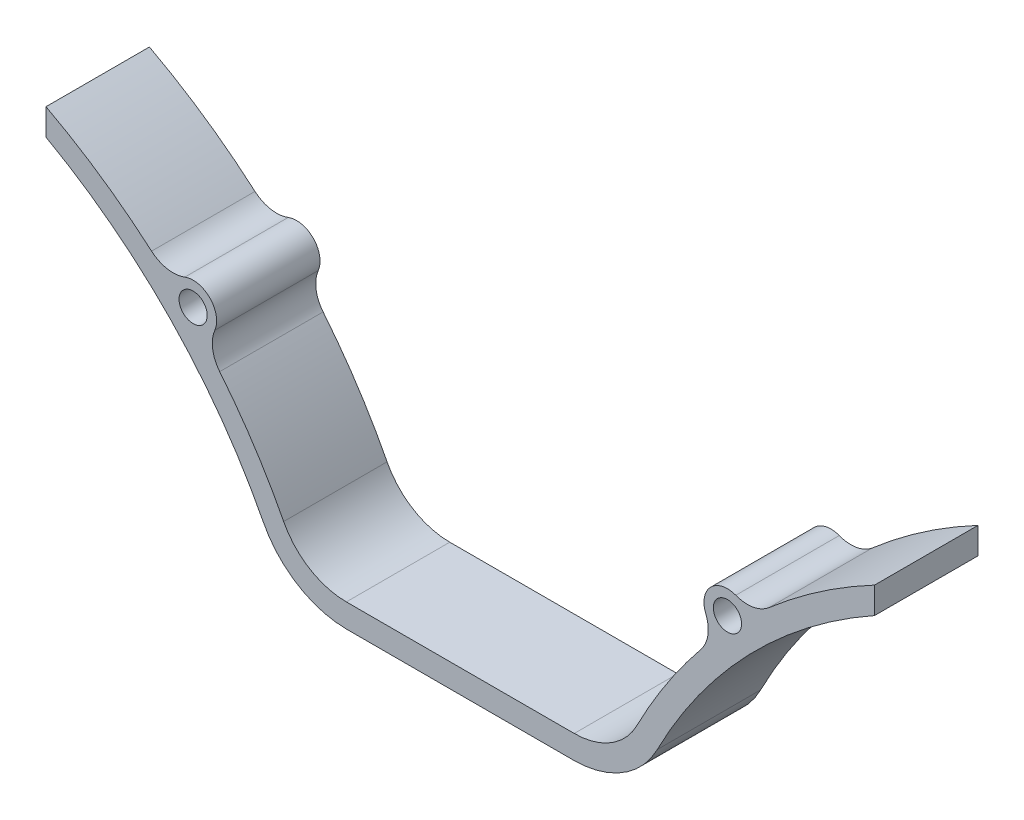
ISO-10303-21;
HEADER;
FILE_DESCRIPTION(('STEP AP214'),'2;1');
FILE_NAME('part.step','',(''),(''),'','','');
FILE_SCHEMA(('AUTOMOTIVE_DESIGN { 1 0 10303 214 1 1 1 1 }'));
ENDSEC;
DATA;
#1=APPLICATION_CONTEXT('core data for automotive mechanical design processes');
#2=APPLICATION_PROTOCOL_DEFINITION('international standard','automotive_design',2000,#1);
#3=PRODUCT_CONTEXT('',#1,'mechanical');
#4=PRODUCT('Part','Part','',(#3));
#5=PRODUCT_RELATED_PRODUCT_CATEGORY('part','',(#4));
#6=PRODUCT_DEFINITION_FORMATION('','',#4);
#7=PRODUCT_DEFINITION_CONTEXT('part definition',#1,'design');
#8=PRODUCT_DEFINITION('design','',#6,#7);
#9=PRODUCT_DEFINITION_SHAPE('','',#8);
#10=(LENGTH_UNIT() NAMED_UNIT(*) SI_UNIT(.MILLI.,.METRE.));
#11=(NAMED_UNIT(*) PLANE_ANGLE_UNIT() SI_UNIT($,.RADIAN.));
#12=(NAMED_UNIT(*) SI_UNIT($,.STERADIAN.) SOLID_ANGLE_UNIT());
#13=UNCERTAINTY_MEASURE_WITH_UNIT(LENGTH_MEASURE(1.E-05),#10,'distance_accuracy_value','');
#14=(GEOMETRIC_REPRESENTATION_CONTEXT(3) GLOBAL_UNCERTAINTY_ASSIGNED_CONTEXT((#13)) GLOBAL_UNIT_ASSIGNED_CONTEXT((#10,
#11,#12)) REPRESENTATION_CONTEXT('',''));
#15=CARTESIAN_POINT('',(0.,0.,0.));
#16=DIRECTION('',(0.,0.,1.));
#17=DIRECTION('',(1.,0.,0.));
#18=AXIS2_PLACEMENT_3D('',#15,#16,#17);
#19=CARTESIAN_POINT('',(-144.278403792599,-109.767419921084,22.));
#20=DIRECTION('',(0.,0.,1.));
#21=DIRECTION('',(1.,0.,0.));
#22=AXIS2_PLACEMENT_3D('',#19,#20,#21);
#23=PLANE('',#22);
#24=CARTESIAN_POINT('',(-56.8349136115492,-25.0288417973948,22.));
#25=DIRECTION('',(0.,0.,1.));
#26=DIRECTION('',(-1.,0.,0.));
#27=AXIS2_PLACEMENT_3D('',#24,#25,#26);
#28=CIRCLE('',#27,3.);
#29=CARTESIAN_POINT('',(-59.8349136115492,-25.0288417973948,22.));
#30=VERTEX_POINT('',#29);
#31=EDGE_CURVE('E210',#30,#30,#28,.T.);
#32=ORIENTED_EDGE('',*,*,#31,.F.);
#33=EDGE_LOOP('',(#32));
#34=FACE_BOUND('',#33,.T.);
#35=CARTESIAN_POINT('',(-144.278403792599,-109.767419921084,22.));
#36=DIRECTION('',(0.,0.,1.));
#37=DIRECTION('',(1.,0.,0.));
#38=AXIS2_PLACEMENT_3D('',#35,#36,#37);
#39=CIRCLE('',#38,120.);
#40=CARTESIAN_POINT('',(-37.5754994432947,-54.8630466578983,22.));
#41=VERTEX_POINT('',#40);
#42=CARTESIAN_POINT('',(-51.18337799803,-34.0487552979641,22.));
#43=VERTEX_POINT('',#42);
#44=EDGE_CURVE('E51',#41,#43,#39,.T.);
#45=ORIENTED_EDGE('',*,*,#44,.T.);
#46=CARTESIAN_POINT('',(-45.7528348266802,-29.6318331949487,22.));
#47=DIRECTION('',(0.,0.,-1.));
#48=DIRECTION('',(-1.,0.,0.));
#49=AXIS2_PLACEMENT_3D('',#46,#47,#48);
#50=CIRCLE('',#49,7.);
#51=CARTESIAN_POINT('',(-52.2173807845204,-26.9467548797089,22.));
#52=VERTEX_POINT('',#51);
#53=EDGE_CURVE('E131',#43,#52,#50,.T.);
#54=ORIENTED_EDGE('',*,*,#53,.T.);
#55=CARTESIAN_POINT('',(-56.8349136115492,-25.0288417973948,22.));
#56=DIRECTION('',(0.,0.,1.));
#57=DIRECTION('',(-1.,0.,0.));
#58=AXIS2_PLACEMENT_3D('',#55,#56,#57);
#59=CIRCLE('',#58,5.);
#60=CARTESIAN_POINT('',(-58.6068368515038,-20.3533431040243,22.));
#61=VERTEX_POINT('',#60);
#62=EDGE_CURVE('E296',#52,#61,#59,.T.);
#63=ORIENTED_EDGE('',*,*,#62,.T.);
#64=CARTESIAN_POINT('',(-61.0875293874402,-13.8076449333057,22.));
#65=DIRECTION('',(0.,0.,-1.));
#66=DIRECTION('',(1.,0.,0.));
#67=AXIS2_PLACEMENT_3D('',#64,#65,#66);
#68=CIRCLE('',#67,6.99999999999999);
#69=CARTESIAN_POINT('',(-65.6728531735513,-19.096766389325,22.));
#70=VERTEX_POINT('',#69);
#71=EDGE_CURVE('E316',#61,#70,#68,.T.);
#72=ORIENTED_EDGE('',*,*,#71,.T.);
#73=CARTESIAN_POINT('',(-144.278403792599,-109.767419921084,22.));
#74=DIRECTION('',(0.,0.,1.));
#75=DIRECTION('',(1.,0.,0.));
#76=AXIS2_PLACEMENT_3D('',#73,#74,#75);
#77=CIRCLE('',#76,120.);
#78=CARTESIAN_POINT('',(-88.1313896805117,-3.71312813476828,22.));
#79=VERTEX_POINT('',#78);
#80=EDGE_CURVE('E313',#70,#79,#77,.T.);
#81=ORIENTED_EDGE('',*,*,#80,.T.);
#82=DIRECTION('',(0.,-1.,0.));
#83=VECTOR('',#82,1.);
#84=CARTESIAN_POINT('',(-88.1313896805117,-3.71312813476826,22.));
#85=LINE('',#84,#83);
#86=CARTESIAN_POINT('',(-88.1313896805117,-9.33211826105709,22.));
#87=VERTEX_POINT('',#86);
#88=EDGE_CURVE('E315',#79,#87,#85,.T.);
#89=ORIENTED_EDGE('',*,*,#88,.T.);
#90=CARTESIAN_POINT('',(-144.147014112087,-109.767419921084,22.));
#91=DIRECTION('',(0.,0.,-1.));
#92=DIRECTION('',(1.,0.,0.));
#93=AXIS2_PLACEMENT_3D('',#90,#91,#92);
#94=CIRCLE('',#93,115.);
#95=CARTESIAN_POINT('',(-41.8900641106707,-57.1507288771977,22.));
#96=VERTEX_POINT('',#95);
#97=EDGE_CURVE('E318',#87,#96,#94,.T.);
#98=ORIENTED_EDGE('',*,*,#97,.T.);
#99=CARTESIAN_POINT('',(-24.1062467191201,-48.,22.));
#100=DIRECTION('',(0.,0.,1.));
#101=DIRECTION('',(1.,0.,0.));
#102=AXIS2_PLACEMENT_3D('',#99,#100,#101);
#103=CIRCLE('',#102,20.);
#104=CARTESIAN_POINT('',(-24.1062467191201,-68.,22.));
#105=VERTEX_POINT('',#104);
#106=EDGE_CURVE('E324',#96,#105,#103,.T.);
#107=ORIENTED_EDGE('',*,*,#106,.T.);
#108=DIRECTION('',(1.,0.,0.));
#109=VECTOR('',#108,1.);
#110=CARTESIAN_POINT('',(-24.1062467191201,-68.,22.));
#111=LINE('',#110,#109);
#112=CARTESIAN_POINT('',(24.1062467191201,-68.,22.));
#113=VERTEX_POINT('',#112);
#114=EDGE_CURVE('E326',#105,#113,#111,.T.);
#115=ORIENTED_EDGE('',*,*,#114,.T.);
#116=CARTESIAN_POINT('',(24.1062467191201,-48.,22.));
#117=DIRECTION('',(0.,0.,1.));
#118=DIRECTION('',(1.,0.,0.));
#119=AXIS2_PLACEMENT_3D('',#116,#117,#118);
#120=CIRCLE('',#119,20.);
#121=CARTESIAN_POINT('',(41.8900641106707,-57.1507288771977,22.));
#122=VERTEX_POINT('',#121);
#123=EDGE_CURVE('E328',#113,#122,#120,.T.);
#124=ORIENTED_EDGE('',*,*,#123,.T.);
#125=CARTESIAN_POINT('',(144.147014112087,-109.767419921084,22.));
#126=DIRECTION('',(0.,0.,-1.));
#127=DIRECTION('',(-1.,0.,0.));
#128=AXIS2_PLACEMENT_3D('',#125,#126,#127);
#129=CIRCLE('',#128,115.);
#130=CARTESIAN_POINT('',(88.1313896805117,-9.33211826105711,22.));
#131=VERTEX_POINT('',#130);
#132=EDGE_CURVE('E330',#122,#131,#129,.T.);
#133=ORIENTED_EDGE('',*,*,#132,.T.);
#134=DIRECTION('',(0.,1.,0.));
#135=VECTOR('',#134,1.);
#136=CARTESIAN_POINT('',(88.1313896805117,-3.71312813476826,22.));
#137=LINE('',#136,#135);
#138=CARTESIAN_POINT('',(88.1313896805117,-3.71312813476826,22.));
#139=VERTEX_POINT('',#138);
#140=EDGE_CURVE('E332',#131,#139,#137,.T.);
#141=ORIENTED_EDGE('',*,*,#140,.T.);
#142=CARTESIAN_POINT('',(144.278403792599,-109.767419921084,22.));
#143=DIRECTION('',(0.,0.,1.));
#144=DIRECTION('',(-1.,0.,0.));
#145=AXIS2_PLACEMENT_3D('',#142,#143,#144);
#146=CIRCLE('',#145,120.);
#147=CARTESIAN_POINT('',(65.6728531735513,-19.096766389325,22.));
#148=VERTEX_POINT('',#147);
#149=EDGE_CURVE('E334',#139,#148,#146,.T.);
#150=ORIENTED_EDGE('',*,*,#149,.T.);
#151=CARTESIAN_POINT('',(61.0875293874402,-13.8076449333057,22.));
#152=DIRECTION('',(0.,0.,-1.));
#153=DIRECTION('',(-1.,0.,0.));
#154=AXIS2_PLACEMENT_3D('',#151,#152,#153);
#155=CIRCLE('',#154,7.);
#156=CARTESIAN_POINT('',(58.6068368515037,-20.3533431040243,22.));
#157=VERTEX_POINT('',#156);
#158=EDGE_CURVE('E336',#148,#157,#155,.T.);
#159=ORIENTED_EDGE('',*,*,#158,.T.);
#160=CARTESIAN_POINT('',(56.8349136115492,-25.0288417973948,22.));
#161=DIRECTION('',(0.,0.,1.));
#162=DIRECTION('',(1.,0.,0.));
#163=AXIS2_PLACEMENT_3D('',#160,#161,#162);
#164=CIRCLE('',#163,5.);
#165=CARTESIAN_POINT('',(52.2173807845204,-26.9467548797089,22.));
#166=VERTEX_POINT('',#165);
#167=EDGE_CURVE('E338',#157,#166,#164,.T.);
#168=ORIENTED_EDGE('',*,*,#167,.T.);
#169=CARTESIAN_POINT('',(45.7528348266801,-29.6318331949487,22.));
#170=DIRECTION('',(0.,0.,-1.));
#171=DIRECTION('',(1.,0.,0.));
#172=AXIS2_PLACEMENT_3D('',#169,#170,#171);
#173=CIRCLE('',#172,7.);
#174=CARTESIAN_POINT('',(51.18337799803,-34.0487552979641,22.));
#175=VERTEX_POINT('',#174);
#176=EDGE_CURVE('E340',#166,#175,#173,.T.);
#177=ORIENTED_EDGE('',*,*,#176,.T.);
#178=CARTESIAN_POINT('',(144.278403792599,-109.767419921084,22.));
#179=DIRECTION('',(0.,0.,1.));
#180=DIRECTION('',(-1.,0.,0.));
#181=AXIS2_PLACEMENT_3D('',#178,#179,#180);
#182=CIRCLE('',#181,120.);
#183=CARTESIAN_POINT('',(37.5754994432947,-54.8630466578983,22.));
#184=VERTEX_POINT('',#183);
#185=EDGE_CURVE('E187',#175,#184,#182,.T.);
#186=ORIENTED_EDGE('',*,*,#185,.T.);
#187=CARTESIAN_POINT('',(24.2376363996317,-48.,22.));
#188=DIRECTION('',(0.,0.,-1.));
#189=DIRECTION('',(1.,0.,0.));
#190=AXIS2_PLACEMENT_3D('',#187,#188,#189);
#191=CIRCLE('',#190,15.);
#192=CARTESIAN_POINT('',(24.2376363996317,-63.,22.));
#193=VERTEX_POINT('',#192);
#194=EDGE_CURVE('E181',#184,#193,#191,.T.);
#195=ORIENTED_EDGE('',*,*,#194,.T.);
#196=DIRECTION('',(-1.,0.,0.));
#197=VECTOR('',#196,1.);
#198=CARTESIAN_POINT('',(-24.2376363996317,-63.,22.));
#199=LINE('',#198,#197);
#200=CARTESIAN_POINT('',(-24.2376363996317,-63.,22.));
#201=VERTEX_POINT('',#200);
#202=EDGE_CURVE('E185',#193,#201,#199,.T.);
#203=ORIENTED_EDGE('',*,*,#202,.T.);
#204=CARTESIAN_POINT('',(-24.2376363996317,-48.,22.));
#205=DIRECTION('',(0.,0.,-1.));
#206=DIRECTION('',(-1.,0.,0.));
#207=AXIS2_PLACEMENT_3D('',#204,#205,#206);
#208=CIRCLE('',#207,15.);
#209=EDGE_CURVE('E201',#201,#41,#208,.T.);
#210=ORIENTED_EDGE('',*,*,#209,.T.);
#211=EDGE_LOOP('',(#45,#54,#63,#72,#81,#89,#98,#107,#115,#124,#133,#141,#150,#159,#168,#177,
#186,#195,#203,#210));
#212=FACE_BOUND('',#211,.T.);
#213=CARTESIAN_POINT('',(56.8349136115492,-25.0288417973948,22.));
#214=DIRECTION('',(0.,0.,1.));
#215=DIRECTION('',(1.,0.,0.));
#216=AXIS2_PLACEMENT_3D('',#213,#214,#215);
#217=CIRCLE('',#216,3.);
#218=CARTESIAN_POINT('',(59.8349136115492,-25.0288417973948,22.));
#219=VERTEX_POINT('',#218);
#220=EDGE_CURVE('E358',#219,#219,#217,.T.);
#221=ORIENTED_EDGE('',*,*,#220,.F.);
#222=EDGE_LOOP('',(#221));
#223=FACE_BOUND('',#222,.T.);
#224=ADVANCED_FACE('F34',(#34,#212,#223),#23,.T.);
#225=CARTESIAN_POINT('',(-144.278403792599,-109.767419921084,0.));
#226=DIRECTION('',(0.,0.,1.));
#227=DIRECTION('',(1.,0.,0.));
#228=AXIS2_PLACEMENT_3D('',#225,#226,#227);
#229=PLANE('',#228);
#230=CARTESIAN_POINT('',(-45.7528348266802,-29.6318331949487,0.));
#231=DIRECTION('',(0.,0.,-1.));
#232=DIRECTION('',(-1.,0.,0.));
#233=AXIS2_PLACEMENT_3D('',#230,#231,#232);
#234=CIRCLE('',#233,7.);
#235=CARTESIAN_POINT('',(-51.18337799803,-34.0487552979641,0.));
#236=VERTEX_POINT('',#235);
#237=CARTESIAN_POINT('',(-52.2173807845204,-26.9467548797089,0.));
#238=VERTEX_POINT('',#237);
#239=EDGE_CURVE('E207',#236,#238,#234,.T.);
#240=ORIENTED_EDGE('',*,*,#239,.F.);
#241=CARTESIAN_POINT('',(-144.278403792599,-109.767419921084,0.));
#242=DIRECTION('',(0.,0.,1.));
#243=DIRECTION('',(1.,0.,0.));
#244=AXIS2_PLACEMENT_3D('',#241,#242,#243);
#245=CIRCLE('',#244,120.);
#246=CARTESIAN_POINT('',(-37.5754994432947,-54.8630466578983,0.));
#247=VERTEX_POINT('',#246);
#248=EDGE_CURVE('E244',#247,#236,#245,.T.);
#249=ORIENTED_EDGE('',*,*,#248,.F.);
#250=CARTESIAN_POINT('',(-24.2376363996317,-48.,0.));
#251=DIRECTION('',(0.,0.,-1.));
#252=DIRECTION('',(-1.,0.,0.));
#253=AXIS2_PLACEMENT_3D('',#250,#251,#252);
#254=CIRCLE('',#253,15.);
#255=CARTESIAN_POINT('',(-24.2376363996317,-63.,0.));
#256=VERTEX_POINT('',#255);
#257=EDGE_CURVE('E124',#256,#247,#254,.T.);
#258=ORIENTED_EDGE('',*,*,#257,.F.);
#259=DIRECTION('',(-1.,0.,0.));
#260=VECTOR('',#259,1.);
#261=CARTESIAN_POINT('',(-24.2376363996317,-63.,0.));
#262=LINE('',#261,#260);
#263=CARTESIAN_POINT('',(24.2376363996317,-63.,0.));
#264=VERTEX_POINT('',#263);
#265=EDGE_CURVE('E117',#264,#256,#262,.T.);
#266=ORIENTED_EDGE('',*,*,#265,.F.);
#267=CARTESIAN_POINT('',(24.2376363996317,-48.,0.));
#268=DIRECTION('',(0.,0.,-1.));
#269=DIRECTION('',(1.,0.,0.));
#270=AXIS2_PLACEMENT_3D('',#267,#268,#269);
#271=CIRCLE('',#270,15.);
#272=CARTESIAN_POINT('',(37.5754994432947,-54.8630466578983,0.));
#273=VERTEX_POINT('',#272);
#274=EDGE_CURVE('E195',#273,#264,#271,.T.);
#275=ORIENTED_EDGE('',*,*,#274,.F.);
#276=CARTESIAN_POINT('',(144.278403792599,-109.767419921084,0.));
#277=DIRECTION('',(0.,0.,1.));
#278=DIRECTION('',(-1.,0.,0.));
#279=AXIS2_PLACEMENT_3D('',#276,#277,#278);
#280=CIRCLE('',#279,120.);
#281=CARTESIAN_POINT('',(51.18337799803,-34.0487552979641,0.));
#282=VERTEX_POINT('',#281);
#283=EDGE_CURVE('E239',#282,#273,#280,.T.);
#284=ORIENTED_EDGE('',*,*,#283,.F.);
#285=CARTESIAN_POINT('',(45.7528348266801,-29.6318331949487,0.));
#286=DIRECTION('',(0.,0.,-1.));
#287=DIRECTION('',(1.,0.,0.));
#288=AXIS2_PLACEMENT_3D('',#285,#286,#287);
#289=CIRCLE('',#288,7.);
#290=CARTESIAN_POINT('',(52.2173807845204,-26.9467548797089,0.));
#291=VERTEX_POINT('',#290);
#292=EDGE_CURVE('E236',#291,#282,#289,.T.);
#293=ORIENTED_EDGE('',*,*,#292,.F.);
#294=CARTESIAN_POINT('',(56.8349136115492,-25.0288417973948,0.));
#295=DIRECTION('',(0.,0.,1.));
#296=DIRECTION('',(1.,0.,0.));
#297=AXIS2_PLACEMENT_3D('',#294,#295,#296);
#298=CIRCLE('',#297,5.);
#299=CARTESIAN_POINT('',(58.6068368515037,-20.3533431040243,0.));
#300=VERTEX_POINT('',#299);
#301=EDGE_CURVE('E234',#300,#291,#298,.T.);
#302=ORIENTED_EDGE('',*,*,#301,.F.);
#303=CARTESIAN_POINT('',(61.0875293874402,-13.8076449333057,0.));
#304=DIRECTION('',(0.,0.,-1.));
#305=DIRECTION('',(-1.,0.,0.));
#306=AXIS2_PLACEMENT_3D('',#303,#304,#305);
#307=CIRCLE('',#306,7.);
#308=CARTESIAN_POINT('',(65.6728531735513,-19.096766389325,0.));
#309=VERTEX_POINT('',#308);
#310=EDGE_CURVE('E232',#309,#300,#307,.T.);
#311=ORIENTED_EDGE('',*,*,#310,.F.);
#312=CARTESIAN_POINT('',(144.278403792599,-109.767419921084,0.));
#313=DIRECTION('',(0.,0.,1.));
#314=DIRECTION('',(-1.,0.,0.));
#315=AXIS2_PLACEMENT_3D('',#312,#313,#314);
#316=CIRCLE('',#315,120.);
#317=CARTESIAN_POINT('',(88.1313896805117,-3.71312813476826,0.));
#318=VERTEX_POINT('',#317);
#319=EDGE_CURVE('E230',#318,#309,#316,.T.);
#320=ORIENTED_EDGE('',*,*,#319,.F.);
#321=DIRECTION('',(0.,1.,0.));
#322=VECTOR('',#321,1.);
#323=CARTESIAN_POINT('',(88.1313896805117,-3.71312813476826,0.));
#324=LINE('',#323,#322);
#325=CARTESIAN_POINT('',(88.1313896805117,-9.33211826105711,0.));
#326=VERTEX_POINT('',#325);
#327=EDGE_CURVE('E228',#326,#318,#324,.T.);
#328=ORIENTED_EDGE('',*,*,#327,.F.);
#329=CARTESIAN_POINT('',(144.147014112087,-109.767419921084,0.));
#330=DIRECTION('',(0.,0.,-1.));
#331=DIRECTION('',(-1.,0.,0.));
#332=AXIS2_PLACEMENT_3D('',#329,#330,#331);
#333=CIRCLE('',#332,115.);
#334=CARTESIAN_POINT('',(41.8900641106707,-57.1507288771977,0.));
#335=VERTEX_POINT('',#334);
#336=EDGE_CURVE('E226',#335,#326,#333,.T.);
#337=ORIENTED_EDGE('',*,*,#336,.F.);
#338=CARTESIAN_POINT('',(24.1062467191201,-48.,0.));
#339=DIRECTION('',(0.,0.,1.));
#340=DIRECTION('',(1.,0.,0.));
#341=AXIS2_PLACEMENT_3D('',#338,#339,#340);
#342=CIRCLE('',#341,20.);
#343=CARTESIAN_POINT('',(24.1062467191201,-68.,0.));
#344=VERTEX_POINT('',#343);
#345=EDGE_CURVE('E224',#344,#335,#342,.T.);
#346=ORIENTED_EDGE('',*,*,#345,.F.);
#347=DIRECTION('',(1.,0.,0.));
#348=VECTOR('',#347,1.);
#349=CARTESIAN_POINT('',(-24.1062467191201,-68.,0.));
#350=LINE('',#349,#348);
#351=CARTESIAN_POINT('',(-24.1062467191201,-68.,0.));
#352=VERTEX_POINT('',#351);
#353=EDGE_CURVE('E222',#352,#344,#350,.T.);
#354=ORIENTED_EDGE('',*,*,#353,.F.);
#355=CARTESIAN_POINT('',(-24.1062467191201,-48.,0.));
#356=DIRECTION('',(0.,0.,1.));
#357=DIRECTION('',(1.,0.,0.));
#358=AXIS2_PLACEMENT_3D('',#355,#356,#357);
#359=CIRCLE('',#358,20.);
#360=CARTESIAN_POINT('',(-41.8900641106707,-57.1507288771977,0.));
#361=VERTEX_POINT('',#360);
#362=EDGE_CURVE('E220',#361,#352,#359,.T.);
#363=ORIENTED_EDGE('',*,*,#362,.F.);
#364=CARTESIAN_POINT('',(-144.147014112087,-109.767419921084,0.));
#365=DIRECTION('',(0.,0.,-1.));
#366=DIRECTION('',(1.,0.,0.));
#367=AXIS2_PLACEMENT_3D('',#364,#365,#366);
#368=CIRCLE('',#367,115.);
#369=CARTESIAN_POINT('',(-88.1313896805117,-9.33211826105709,0.));
#370=VERTEX_POINT('',#369);
#371=EDGE_CURVE('E218',#370,#361,#368,.T.);
#372=ORIENTED_EDGE('',*,*,#371,.F.);
#373=DIRECTION('',(0.,-1.,0.));
#374=VECTOR('',#373,1.);
#375=CARTESIAN_POINT('',(-88.1313896805117,-3.71312813476826,0.));
#376=LINE('',#375,#374);
#377=CARTESIAN_POINT('',(-88.1313896805117,-3.71312813476828,0.));
#378=VERTEX_POINT('',#377);
#379=EDGE_CURVE('E216',#378,#370,#376,.T.);
#380=ORIENTED_EDGE('',*,*,#379,.F.);
#381=CARTESIAN_POINT('',(-144.278403792599,-109.767419921084,0.));
#382=DIRECTION('',(0.,0.,1.));
#383=DIRECTION('',(1.,0.,0.));
#384=AXIS2_PLACEMENT_3D('',#381,#382,#383);
#385=CIRCLE('',#384,120.);
#386=CARTESIAN_POINT('',(-65.6728531735513,-19.096766389325,0.));
#387=VERTEX_POINT('',#386);
#388=EDGE_CURVE('E214',#387,#378,#385,.T.);
#389=ORIENTED_EDGE('',*,*,#388,.F.);
#390=CARTESIAN_POINT('',(-61.0875293874402,-13.8076449333057,0.));
#391=DIRECTION('',(0.,0.,-1.));
#392=DIRECTION('',(1.,0.,0.));
#393=AXIS2_PLACEMENT_3D('',#390,#391,#392);
#394=CIRCLE('',#393,6.99999999999999);
#395=CARTESIAN_POINT('',(-58.6068368515038,-20.3533431040243,0.));
#396=VERTEX_POINT('',#395);
#397=EDGE_CURVE('E212',#396,#387,#394,.T.);
#398=ORIENTED_EDGE('',*,*,#397,.F.);
#399=CARTESIAN_POINT('',(-56.8349136115492,-25.0288417973948,0.));
#400=DIRECTION('',(0.,0.,1.));
#401=DIRECTION('',(-1.,0.,0.));
#402=AXIS2_PLACEMENT_3D('',#399,#400,#401);
#403=CIRCLE('',#402,5.);
#404=EDGE_CURVE('E209',#238,#396,#403,.T.);
#405=ORIENTED_EDGE('',*,*,#404,.F.);
#406=EDGE_LOOP('',(#240,#249,#258,#266,#275,#284,#293,#302,#311,#320,#328,#337,#346,#354,#363,
#372,#380,#389,#398,#405));
#407=FACE_BOUND('',#406,.T.);
#408=CARTESIAN_POINT('',(-56.8349136115492,-25.0288417973948,0.));
#409=DIRECTION('',(0.,0.,1.));
#410=DIRECTION('',(-1.,0.,0.));
#411=AXIS2_PLACEMENT_3D('',#408,#409,#410);
#412=CIRCLE('',#411,3.);
#413=CARTESIAN_POINT('',(-59.8349136115492,-25.0288417973948,0.));
#414=VERTEX_POINT('',#413);
#415=EDGE_CURVE('E355',#414,#414,#412,.T.);
#416=ORIENTED_EDGE('',*,*,#415,.T.);
#417=EDGE_LOOP('',(#416));
#418=FACE_BOUND('',#417,.T.);
#419=CARTESIAN_POINT('',(56.8349136115492,-25.0288417973948,0.));
#420=DIRECTION('',(0.,0.,1.));
#421=DIRECTION('',(1.,0.,0.));
#422=AXIS2_PLACEMENT_3D('',#419,#420,#421);
#423=CIRCLE('',#422,3.);
#424=CARTESIAN_POINT('',(59.8349136115492,-25.0288417973948,0.));
#425=VERTEX_POINT('',#424);
#426=EDGE_CURVE('E361',#425,#425,#423,.T.);
#427=ORIENTED_EDGE('',*,*,#426,.T.);
#428=EDGE_LOOP('',(#427));
#429=FACE_BOUND('',#428,.T.);
#430=ADVANCED_FACE('F300',(#407,#418,#429),#229,.F.);
#431=CARTESIAN_POINT('',(-45.7528348266802,-29.6318331949487,22.));
#432=DIRECTION('',(0.,0.,-1.));
#433=DIRECTION('',(-1.,0.,0.));
#434=AXIS2_PLACEMENT_3D('',#431,#432,#433);
#435=CYLINDRICAL_SURFACE('',#434,7.);
#436=ORIENTED_EDGE('',*,*,#239,.T.);
#437=DIRECTION('',(0.,0.,-1.));
#438=VECTOR('',#437,1.);
#439=CARTESIAN_POINT('',(-52.2173807845204,-26.9467548797089,22.));
#440=LINE('',#439,#438);
#441=EDGE_CURVE('E43',#52,#238,#440,.T.);
#442=ORIENTED_EDGE('',*,*,#441,.F.);
#443=ORIENTED_EDGE('',*,*,#53,.F.);
#444=DIRECTION('',(0.,0.,-1.));
#445=VECTOR('',#444,1.);
#446=CARTESIAN_POINT('',(-51.18337799803,-34.0487552979641,22.));
#447=LINE('',#446,#445);
#448=EDGE_CURVE('E11',#43,#236,#447,.T.);
#449=ORIENTED_EDGE('',*,*,#448,.T.);
#450=EDGE_LOOP('',(#436,#442,#443,#449));
#451=FACE_BOUND('',#450,.T.);
#452=ADVANCED_FACE('F36',(#451),#435,.F.);
#453=CARTESIAN_POINT('',(-56.8349136115492,-25.0288417973948,22.));
#454=DIRECTION('',(0.,0.,-1.));
#455=DIRECTION('',(-1.,0.,0.));
#456=AXIS2_PLACEMENT_3D('',#453,#454,#455);
#457=CYLINDRICAL_SURFACE('',#456,5.);
#458=ORIENTED_EDGE('',*,*,#404,.T.);
#459=DIRECTION('',(0.,0.,-1.));
#460=VECTOR('',#459,1.);
#461=CARTESIAN_POINT('',(-58.6068368515038,-20.3533431040243,22.));
#462=LINE('',#461,#460);
#463=EDGE_CURVE('E288',#61,#396,#462,.T.);
#464=ORIENTED_EDGE('',*,*,#463,.F.);
#465=ORIENTED_EDGE('',*,*,#62,.F.);
#466=ORIENTED_EDGE('',*,*,#441,.T.);
#467=EDGE_LOOP('',(#458,#464,#465,#466));
#468=FACE_BOUND('',#467,.T.);
#469=ADVANCED_FACE('F294',(#468),#457,.T.);
#470=CARTESIAN_POINT('',(-61.0875293874402,-13.8076449333057,22.));
#471=DIRECTION('',(0.,0.,-1.));
#472=DIRECTION('',(-1.,0.,0.));
#473=AXIS2_PLACEMENT_3D('',#470,#471,#472);
#474=CYLINDRICAL_SURFACE('',#473,6.99999999999999);
#475=ORIENTED_EDGE('',*,*,#397,.T.);
#476=DIRECTION('',(0.,0.,-1.));
#477=VECTOR('',#476,1.);
#478=CARTESIAN_POINT('',(-65.6728531735513,-19.096766389325,22.));
#479=LINE('',#478,#477);
#480=EDGE_CURVE('E285',#70,#387,#479,.T.);
#481=ORIENTED_EDGE('',*,*,#480,.F.);
#482=ORIENTED_EDGE('',*,*,#71,.F.);
#483=ORIENTED_EDGE('',*,*,#463,.T.);
#484=EDGE_LOOP('',(#475,#481,#482,#483));
#485=FACE_BOUND('',#484,.T.);
#486=ADVANCED_FACE('F307',(#485),#474,.F.);
#487=CARTESIAN_POINT('',(-144.278403792599,-109.767419921084,22.));
#488=DIRECTION('',(0.,0.,-1.));
#489=DIRECTION('',(-1.,0.,0.));
#490=AXIS2_PLACEMENT_3D('',#487,#488,#489);
#491=CYLINDRICAL_SURFACE('',#490,120.);
#492=ORIENTED_EDGE('',*,*,#388,.T.);
#493=DIRECTION('',(0.,0.,-1.));
#494=VECTOR('',#493,1.);
#495=CARTESIAN_POINT('',(-88.1313896805117,-3.71312813476828,22.));
#496=LINE('',#495,#494);
#497=EDGE_CURVE('E282',#79,#378,#496,.T.);
#498=ORIENTED_EDGE('',*,*,#497,.F.);
#499=ORIENTED_EDGE('',*,*,#80,.F.);
#500=ORIENTED_EDGE('',*,*,#480,.T.);
#501=EDGE_LOOP('',(#492,#498,#499,#500));
#502=FACE_BOUND('',#501,.T.);
#503=ADVANCED_FACE('F311',(#502),#491,.T.);
#504=CARTESIAN_POINT('',(-88.1313896805117,-3.71312813476826,22.));
#505=DIRECTION('',(1.,0.,0.));
#506=DIRECTION('',(0.,0.,-1.));
#507=AXIS2_PLACEMENT_3D('',#504,#505,#506);
#508=PLANE('',#507);
#509=ORIENTED_EDGE('',*,*,#379,.T.);
#510=DIRECTION('',(0.,0.,-1.));
#511=VECTOR('',#510,1.);
#512=CARTESIAN_POINT('',(-88.1313896805117,-9.33211826105709,22.));
#513=LINE('',#512,#511);
#514=EDGE_CURVE('E279',#87,#370,#513,.T.);
#515=ORIENTED_EDGE('',*,*,#514,.F.);
#516=ORIENTED_EDGE('',*,*,#88,.F.);
#517=ORIENTED_EDGE('',*,*,#497,.T.);
#518=EDGE_LOOP('',(#509,#515,#516,#517));
#519=FACE_BOUND('',#518,.T.);
#520=ADVANCED_FACE('F428',(#519),#508,.F.);
#521=CARTESIAN_POINT('',(-144.147014112087,-109.767419921084,22.));
#522=DIRECTION('',(0.,0.,-1.));
#523=DIRECTION('',(-1.,0.,0.));
#524=AXIS2_PLACEMENT_3D('',#521,#522,#523);
#525=CYLINDRICAL_SURFACE('',#524,115.);
#526=ORIENTED_EDGE('',*,*,#371,.T.);
#527=DIRECTION('',(0.,0.,-1.));
#528=VECTOR('',#527,1.);
#529=CARTESIAN_POINT('',(-41.8900641106707,-57.1507288771977,22.));
#530=LINE('',#529,#528);
#531=EDGE_CURVE('E276',#96,#361,#530,.T.);
#532=ORIENTED_EDGE('',*,*,#531,.F.);
#533=ORIENTED_EDGE('',*,*,#97,.F.);
#534=ORIENTED_EDGE('',*,*,#514,.T.);
#535=EDGE_LOOP('',(#526,#532,#533,#534));
#536=FACE_BOUND('',#535,.T.);
#537=ADVANCED_FACE('F424',(#536),#525,.F.);
#538=CARTESIAN_POINT('',(-24.1062467191201,-48.,22.));
#539=DIRECTION('',(0.,0.,-1.));
#540=DIRECTION('',(-1.,0.,0.));
#541=AXIS2_PLACEMENT_3D('',#538,#539,#540);
#542=CYLINDRICAL_SURFACE('',#541,20.);
#543=ORIENTED_EDGE('',*,*,#362,.T.);
#544=DIRECTION('',(0.,0.,-1.));
#545=VECTOR('',#544,1.);
#546=CARTESIAN_POINT('',(-24.1062467191201,-68.,22.));
#547=LINE('',#546,#545);
#548=EDGE_CURVE('E273',#105,#352,#547,.T.);
#549=ORIENTED_EDGE('',*,*,#548,.F.);
#550=ORIENTED_EDGE('',*,*,#106,.F.);
#551=ORIENTED_EDGE('',*,*,#531,.T.);
#552=EDGE_LOOP('',(#543,#549,#550,#551));
#553=FACE_BOUND('',#552,.T.);
#554=ADVANCED_FACE('F420',(#553),#542,.T.);
#555=CARTESIAN_POINT('',(-24.1062467191201,-68.,22.));
#556=DIRECTION('',(0.,1.,0.));
#557=DIRECTION('',(0.,0.,1.));
#558=AXIS2_PLACEMENT_3D('',#555,#556,#557);
#559=PLANE('',#558);
#560=ORIENTED_EDGE('',*,*,#353,.T.);
#561=DIRECTION('',(0.,0.,-1.));
#562=VECTOR('',#561,1.);
#563=CARTESIAN_POINT('',(24.1062467191201,-68.,22.));
#564=LINE('',#563,#562);
#565=EDGE_CURVE('E270',#113,#344,#564,.T.);
#566=ORIENTED_EDGE('',*,*,#565,.F.);
#567=ORIENTED_EDGE('',*,*,#114,.F.);
#568=ORIENTED_EDGE('',*,*,#548,.T.);
#569=EDGE_LOOP('',(#560,#566,#567,#568));
#570=FACE_BOUND('',#569,.T.);
#571=ADVANCED_FACE('F416',(#570),#559,.F.);
#572=CARTESIAN_POINT('',(24.1062467191201,-48.,22.));
#573=DIRECTION('',(0.,0.,-1.));
#574=DIRECTION('',(-1.,0.,0.));
#575=AXIS2_PLACEMENT_3D('',#572,#573,#574);
#576=CYLINDRICAL_SURFACE('',#575,20.);
#577=ORIENTED_EDGE('',*,*,#345,.T.);
#578=DIRECTION('',(0.,0.,-1.));
#579=VECTOR('',#578,1.);
#580=CARTESIAN_POINT('',(41.8900641106707,-57.1507288771977,22.));
#581=LINE('',#580,#579);
#582=EDGE_CURVE('E267',#122,#335,#581,.T.);
#583=ORIENTED_EDGE('',*,*,#582,.F.);
#584=ORIENTED_EDGE('',*,*,#123,.F.);
#585=ORIENTED_EDGE('',*,*,#565,.T.);
#586=EDGE_LOOP('',(#577,#583,#584,#585));
#587=FACE_BOUND('',#586,.T.);
#588=ADVANCED_FACE('F412',(#587),#576,.T.);
#589=CARTESIAN_POINT('',(144.147014112087,-109.767419921084,22.));
#590=DIRECTION('',(0.,0.,-1.));
#591=DIRECTION('',(-1.,0.,0.));
#592=AXIS2_PLACEMENT_3D('',#589,#590,#591);
#593=CYLINDRICAL_SURFACE('',#592,115.);
#594=ORIENTED_EDGE('',*,*,#336,.T.);
#595=DIRECTION('',(0.,0.,-1.));
#596=VECTOR('',#595,1.);
#597=CARTESIAN_POINT('',(88.1313896805117,-9.33211826105711,22.));
#598=LINE('',#597,#596);
#599=EDGE_CURVE('E264',#131,#326,#598,.T.);
#600=ORIENTED_EDGE('',*,*,#599,.F.);
#601=ORIENTED_EDGE('',*,*,#132,.F.);
#602=ORIENTED_EDGE('',*,*,#582,.T.);
#603=EDGE_LOOP('',(#594,#600,#601,#602));
#604=FACE_BOUND('',#603,.T.);
#605=ADVANCED_FACE('F408',(#604),#593,.F.);
#606=CARTESIAN_POINT('',(88.1313896805117,-3.71312813476826,22.));
#607=DIRECTION('',(-1.,0.,0.));
#608=DIRECTION('',(0.,0.,1.));
#609=AXIS2_PLACEMENT_3D('',#606,#607,#608);
#610=PLANE('',#609);
#611=ORIENTED_EDGE('',*,*,#327,.T.);
#612=DIRECTION('',(0.,0.,-1.));
#613=VECTOR('',#612,1.);
#614=CARTESIAN_POINT('',(88.1313896805117,-3.71312813476826,22.));
#615=LINE('',#614,#613);
#616=EDGE_CURVE('E261',#139,#318,#615,.T.);
#617=ORIENTED_EDGE('',*,*,#616,.F.);
#618=ORIENTED_EDGE('',*,*,#140,.F.);
#619=ORIENTED_EDGE('',*,*,#599,.T.);
#620=EDGE_LOOP('',(#611,#617,#618,#619));
#621=FACE_BOUND('',#620,.T.);
#622=ADVANCED_FACE('F404',(#621),#610,.F.);
#623=CARTESIAN_POINT('',(144.278403792599,-109.767419921084,22.));
#624=DIRECTION('',(0.,0.,-1.));
#625=DIRECTION('',(-1.,0.,0.));
#626=AXIS2_PLACEMENT_3D('',#623,#624,#625);
#627=CYLINDRICAL_SURFACE('',#626,120.);
#628=ORIENTED_EDGE('',*,*,#319,.T.);
#629=DIRECTION('',(0.,0.,-1.));
#630=VECTOR('',#629,1.);
#631=CARTESIAN_POINT('',(65.6728531735513,-19.096766389325,22.));
#632=LINE('',#631,#630);
#633=EDGE_CURVE('E258',#148,#309,#632,.T.);
#634=ORIENTED_EDGE('',*,*,#633,.F.);
#635=ORIENTED_EDGE('',*,*,#149,.F.);
#636=ORIENTED_EDGE('',*,*,#616,.T.);
#637=EDGE_LOOP('',(#628,#634,#635,#636));
#638=FACE_BOUND('',#637,.T.);
#639=ADVANCED_FACE('F400',(#638),#627,.T.);
#640=CARTESIAN_POINT('',(61.0875293874402,-13.8076449333057,22.));
#641=DIRECTION('',(0.,0.,-1.));
#642=DIRECTION('',(-1.,0.,0.));
#643=AXIS2_PLACEMENT_3D('',#640,#641,#642);
#644=CYLINDRICAL_SURFACE('',#643,7.);
#645=ORIENTED_EDGE('',*,*,#310,.T.);
#646=DIRECTION('',(0.,0.,-1.));
#647=VECTOR('',#646,1.);
#648=CARTESIAN_POINT('',(58.6068368515037,-20.3533431040243,22.));
#649=LINE('',#648,#647);
#650=EDGE_CURVE('E255',#157,#300,#649,.T.);
#651=ORIENTED_EDGE('',*,*,#650,.F.);
#652=ORIENTED_EDGE('',*,*,#158,.F.);
#653=ORIENTED_EDGE('',*,*,#633,.T.);
#654=EDGE_LOOP('',(#645,#651,#652,#653));
#655=FACE_BOUND('',#654,.T.);
#656=ADVANCED_FACE('F396',(#655),#644,.F.);
#657=CARTESIAN_POINT('',(56.8349136115492,-25.0288417973948,22.));
#658=DIRECTION('',(0.,0.,-1.));
#659=DIRECTION('',(-1.,0.,0.));
#660=AXIS2_PLACEMENT_3D('',#657,#658,#659);
#661=CYLINDRICAL_SURFACE('',#660,5.);
#662=ORIENTED_EDGE('',*,*,#301,.T.);
#663=DIRECTION('',(0.,0.,-1.));
#664=VECTOR('',#663,1.);
#665=CARTESIAN_POINT('',(52.2173807845204,-26.9467548797089,22.));
#666=LINE('',#665,#664);
#667=EDGE_CURVE('E252',#166,#291,#666,.T.);
#668=ORIENTED_EDGE('',*,*,#667,.F.);
#669=ORIENTED_EDGE('',*,*,#167,.F.);
#670=ORIENTED_EDGE('',*,*,#650,.T.);
#671=EDGE_LOOP('',(#662,#668,#669,#670));
#672=FACE_BOUND('',#671,.T.);
#673=ADVANCED_FACE('F393',(#672),#661,.T.);
#674=CARTESIAN_POINT('',(45.7528348266801,-29.6318331949487,22.));
#675=DIRECTION('',(0.,0.,-1.));
#676=DIRECTION('',(-1.,0.,0.));
#677=AXIS2_PLACEMENT_3D('',#674,#675,#676);
#678=CYLINDRICAL_SURFACE('',#677,7.);
#679=ORIENTED_EDGE('',*,*,#292,.T.);
#680=DIRECTION('',(0.,0.,-1.));
#681=VECTOR('',#680,1.);
#682=CARTESIAN_POINT('',(51.18337799803,-34.0487552979641,22.));
#683=LINE('',#682,#681);
#684=EDGE_CURVE('E249',#175,#282,#683,.T.);
#685=ORIENTED_EDGE('',*,*,#684,.F.);
#686=ORIENTED_EDGE('',*,*,#176,.F.);
#687=ORIENTED_EDGE('',*,*,#667,.T.);
#688=EDGE_LOOP('',(#679,#685,#686,#687));
#689=FACE_BOUND('',#688,.T.);
#690=ADVANCED_FACE('F346',(#689),#678,.F.);
#691=CARTESIAN_POINT('',(144.278403792599,-109.767419921084,22.));
#692=DIRECTION('',(0.,0.,-1.));
#693=DIRECTION('',(-1.,0.,0.));
#694=AXIS2_PLACEMENT_3D('',#691,#692,#693);
#695=CYLINDRICAL_SURFACE('',#694,120.);
#696=ORIENTED_EDGE('',*,*,#283,.T.);
#697=DIRECTION('',(0.,0.,-1.));
#698=VECTOR('',#697,1.);
#699=CARTESIAN_POINT('',(37.5754994432947,-54.8630466578983,22.));
#700=LINE('',#699,#698);
#701=EDGE_CURVE('E196',#184,#273,#700,.T.);
#702=ORIENTED_EDGE('',*,*,#701,.F.);
#703=ORIENTED_EDGE('',*,*,#185,.F.);
#704=ORIENTED_EDGE('',*,*,#684,.T.);
#705=EDGE_LOOP('',(#696,#702,#703,#704));
#706=FACE_BOUND('',#705,.T.);
#707=ADVANCED_FACE('F349',(#706),#695,.T.);
#708=CARTESIAN_POINT('',(24.2376363996317,-48.,22.));
#709=DIRECTION('',(0.,0.,-1.));
#710=DIRECTION('',(-1.,0.,0.));
#711=AXIS2_PLACEMENT_3D('',#708,#709,#710);
#712=CYLINDRICAL_SURFACE('',#711,15.);
#713=ORIENTED_EDGE('',*,*,#274,.T.);
#714=DIRECTION('',(0.,0.,-1.));
#715=VECTOR('',#714,1.);
#716=CARTESIAN_POINT('',(24.2376363996317,-63.,22.));
#717=LINE('',#716,#715);
#718=EDGE_CURVE('E192',#193,#264,#717,.T.);
#719=ORIENTED_EDGE('',*,*,#718,.F.);
#720=ORIENTED_EDGE('',*,*,#194,.F.);
#721=ORIENTED_EDGE('',*,*,#701,.T.);
#722=EDGE_LOOP('',(#713,#719,#720,#721));
#723=FACE_BOUND('',#722,.T.);
#724=ADVANCED_FACE('F193',(#723),#712,.F.);
#725=CARTESIAN_POINT('',(-24.2376363996317,-63.,22.));
#726=DIRECTION('',(0.,-1.,0.));
#727=DIRECTION('',(0.,0.,-1.));
#728=AXIS2_PLACEMENT_3D('',#725,#726,#727);
#729=PLANE('',#728);
#730=ORIENTED_EDGE('',*,*,#265,.T.);
#731=DIRECTION('',(0.,0.,-1.));
#732=VECTOR('',#731,1.);
#733=CARTESIAN_POINT('',(-24.2376363996317,-63.,22.));
#734=LINE('',#733,#732);
#735=EDGE_CURVE('E197',#201,#256,#734,.T.);
#736=ORIENTED_EDGE('',*,*,#735,.F.);
#737=ORIENTED_EDGE('',*,*,#202,.F.);
#738=ORIENTED_EDGE('',*,*,#718,.T.);
#739=EDGE_LOOP('',(#730,#736,#737,#738));
#740=FACE_BOUND('',#739,.T.);
#741=ADVANCED_FACE('F199',(#740),#729,.F.);
#742=CARTESIAN_POINT('',(-24.2376363996317,-48.,22.));
#743=DIRECTION('',(0.,0.,-1.));
#744=DIRECTION('',(-1.,0.,0.));
#745=AXIS2_PLACEMENT_3D('',#742,#743,#744);
#746=CYLINDRICAL_SURFACE('',#745,15.);
#747=ORIENTED_EDGE('',*,*,#257,.T.);
#748=DIRECTION('',(0.,0.,-1.));
#749=VECTOR('',#748,1.);
#750=CARTESIAN_POINT('',(-37.5754994432947,-54.8630466578983,22.));
#751=LINE('',#750,#749);
#752=EDGE_CURVE('E203',#41,#247,#751,.T.);
#753=ORIENTED_EDGE('',*,*,#752,.F.);
#754=ORIENTED_EDGE('',*,*,#209,.F.);
#755=ORIENTED_EDGE('',*,*,#735,.T.);
#756=EDGE_LOOP('',(#747,#753,#754,#755));
#757=FACE_BOUND('',#756,.T.);
#758=ADVANCED_FACE('F351',(#757),#746,.F.);
#759=CARTESIAN_POINT('',(-144.278403792599,-109.767419921084,22.));
#760=DIRECTION('',(0.,0.,-1.));
#761=DIRECTION('',(-1.,0.,0.));
#762=AXIS2_PLACEMENT_3D('',#759,#760,#761);
#763=CYLINDRICAL_SURFACE('',#762,120.);
#764=ORIENTED_EDGE('',*,*,#248,.T.);
#765=ORIENTED_EDGE('',*,*,#448,.F.);
#766=ORIENTED_EDGE('',*,*,#44,.F.);
#767=ORIENTED_EDGE('',*,*,#752,.T.);
#768=EDGE_LOOP('',(#764,#765,#766,#767));
#769=FACE_BOUND('',#768,.T.);
#770=ADVANCED_FACE('F350',(#769),#763,.T.);
#771=CARTESIAN_POINT('',(-56.8349136115492,-25.0288417973948,22.));
#772=DIRECTION('',(0.,0.,-1.));
#773=DIRECTION('',(-1.,0.,0.));
#774=AXIS2_PLACEMENT_3D('',#771,#772,#773);
#775=CYLINDRICAL_SURFACE('',#774,3.);
#776=ORIENTED_EDGE('',*,*,#31,.T.);
#777=EDGE_LOOP('',(#776));
#778=FACE_BOUND('',#777,.T.);
#779=ORIENTED_EDGE('',*,*,#415,.F.);
#780=EDGE_LOOP('',(#779));
#781=FACE_BOUND('',#780,.T.);
#782=ADVANCED_FACE('F378',(#778,#781),#775,.F.);
#783=CARTESIAN_POINT('',(56.8349136115492,-25.0288417973948,22.));
#784=DIRECTION('',(0.,0.,-1.));
#785=DIRECTION('',(-1.,0.,0.));
#786=AXIS2_PLACEMENT_3D('',#783,#784,#785);
#787=CYLINDRICAL_SURFACE('',#786,3.);
#788=ORIENTED_EDGE('',*,*,#220,.T.);
#789=EDGE_LOOP('',(#788));
#790=FACE_BOUND('',#789,.T.);
#791=ORIENTED_EDGE('',*,*,#426,.F.);
#792=EDGE_LOOP('',(#791));
#793=FACE_BOUND('',#792,.T.);
#794=ADVANCED_FACE('F367',(#790,#793),#787,.F.);
#795=CLOSED_SHELL('',(#224,#430,#452,#469,#486,#503,#520,#537,#554,#571,#588,#605,#622,#639,
#656,#673,#690,#707,#724,#741,#758,#770,#782,#794));
#796=MANIFOLD_SOLID_BREP('B2',#795);
#797=ADVANCED_BREP_SHAPE_REPRESENTATION('',(#18,#796),#14);
#798=SHAPE_DEFINITION_REPRESENTATION(#9,#797);
ENDSEC;
END-ISO-10303-21;
